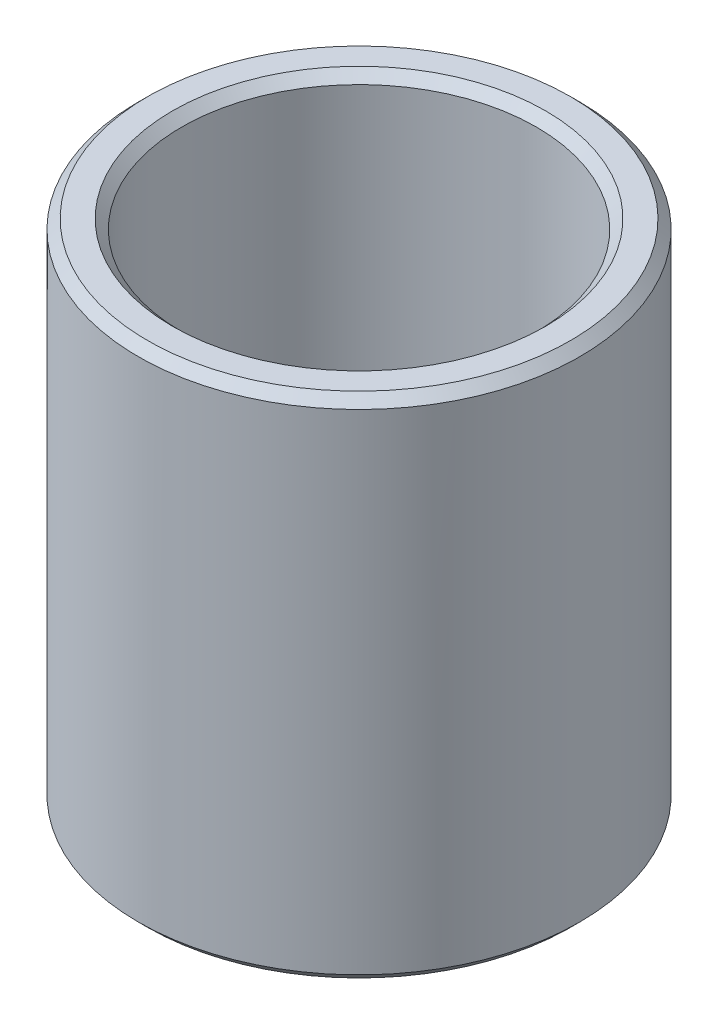
ISO-10303-21;
HEADER;
FILE_DESCRIPTION(('STEP AP214'),'2;1');
FILE_NAME('part.step','',(''),(''),'','','');
FILE_SCHEMA(('AUTOMOTIVE_DESIGN { 1 0 10303 214 1 1 1 1 }'));
ENDSEC;
DATA;
#1=APPLICATION_CONTEXT('core data for automotive mechanical design processes');
#2=APPLICATION_PROTOCOL_DEFINITION('international standard','automotive_design',2000,#1);
#3=PRODUCT_CONTEXT('',#1,'mechanical');
#4=PRODUCT('Part','Part','',(#3));
#5=PRODUCT_RELATED_PRODUCT_CATEGORY('part','',(#4));
#6=PRODUCT_DEFINITION_FORMATION('','',#4);
#7=PRODUCT_DEFINITION_CONTEXT('part definition',#1,'design');
#8=PRODUCT_DEFINITION('design','',#6,#7);
#9=PRODUCT_DEFINITION_SHAPE('','',#8);
#10=(LENGTH_UNIT() NAMED_UNIT(*) SI_UNIT(.MILLI.,.METRE.));
#11=(NAMED_UNIT(*) PLANE_ANGLE_UNIT() SI_UNIT($,.RADIAN.));
#12=(NAMED_UNIT(*) SI_UNIT($,.STERADIAN.) SOLID_ANGLE_UNIT());
#13=UNCERTAINTY_MEASURE_WITH_UNIT(LENGTH_MEASURE(1.E-05),#10,'distance_accuracy_value','');
#14=(GEOMETRIC_REPRESENTATION_CONTEXT(3) GLOBAL_UNCERTAINTY_ASSIGNED_CONTEXT((#13)) GLOBAL_UNIT_ASSIGNED_CONTEXT((#10,
#11,#12)) REPRESENTATION_CONTEXT('',''));
#15=CARTESIAN_POINT('',(0.,0.,0.));
#16=DIRECTION('',(0.,0.,1.));
#17=DIRECTION('',(1.,0.,0.));
#18=AXIS2_PLACEMENT_3D('',#15,#16,#17);
#19=CARTESIAN_POINT('',(0.,74.8433364922086,0.));
#20=DIRECTION('',(0.,-1.,0.));
#21=DIRECTION('',(0.,0.,-1.));
#22=AXIS2_PLACEMENT_3D('',#19,#20,#21);
#23=CYLINDRICAL_SURFACE('',#22,32.5);
#24=CARTESIAN_POINT('',(0.,1.37046416115859,0.));
#25=DIRECTION('',(0.,1.,0.));
#26=DIRECTION('',(0.,0.,1.));
#27=AXIS2_PLACEMENT_3D('',#24,#25,#26);
#28=CIRCLE('',#27,32.5);
#29=CARTESIAN_POINT('',(0.,1.37046416115857,-32.5));
#30=VERTEX_POINT('',#29);
#31=EDGE_CURVE('E10',#30,#30,#28,.T.);
#32=CARTESIAN_POINT('',(0.,73.4728723310501,0.));
#33=DIRECTION('',(0.,1.,0.));
#34=DIRECTION('',(0.,0.,1.));
#35=AXIS2_PLACEMENT_3D('',#32,#33,#34);
#36=CIRCLE('',#35,32.5);
#37=CARTESIAN_POINT('',(0.,73.4728723310501,-32.5));
#38=VERTEX_POINT('',#37);
#39=EDGE_CURVE('E50',#38,#38,#36,.F.);
#40=CARTESIAN_POINT('',(0.,1.37046416115857,-32.5));
#41=CARTESIAN_POINT('',(0.,2.12153091292828,-32.5));
#42=CARTESIAN_POINT('',(0.,2.87259766469798,-32.5));
#43=CARTESIAN_POINT('',(0.,4.37473116823738,-32.5));
#44=CARTESIAN_POINT('',(0.,5.12579792000709,-32.5));
#45=CARTESIAN_POINT('',(0.,6.6279314235465,-32.5));
#46=CARTESIAN_POINT('',(0.,7.3789981753162,-32.5));
#47=CARTESIAN_POINT('',(0.,8.88113167885561,-32.5));
#48=CARTESIAN_POINT('',(0.,9.63219843062531,-32.5));
#49=CARTESIAN_POINT('',(0.,11.1343319341647,-32.5));
#50=CARTESIAN_POINT('',(0.,11.8853986859344,-32.5));
#51=CARTESIAN_POINT('',(0.,13.3875321894738,-32.5));
#52=CARTESIAN_POINT('',(0.,14.1385989412435,-32.5));
#53=CARTESIAN_POINT('',(0.,15.6407324447829,-32.5));
#54=CARTESIAN_POINT('',(0.,16.3917991965526,-32.5));
#55=CARTESIAN_POINT('',(0.,17.893932700092,-32.5));
#56=CARTESIAN_POINT('',(0.,18.6449994518617,-32.5));
#57=CARTESIAN_POINT('',(0.,20.1471329554012,-32.5));
#58=CARTESIAN_POINT('',(0.,20.8981997071709,-32.5));
#59=CARTESIAN_POINT('',(0.,22.4003332107103,-32.5));
#60=CARTESIAN_POINT('',(0.,23.15139996248,-32.5));
#61=CARTESIAN_POINT('',(0.,24.6535334660194,-32.5));
#62=CARTESIAN_POINT('',(0.,25.4046002177891,-32.5));
#63=CARTESIAN_POINT('',(0.,26.9067337213285,-32.5));
#64=CARTESIAN_POINT('',(0.,27.6578004730982,-32.5));
#65=CARTESIAN_POINT('',(0.,29.1599339766376,-32.5));
#66=CARTESIAN_POINT('',(0.,29.9110007284073,-32.5));
#67=CARTESIAN_POINT('',(0.,31.4131342319467,-32.5));
#68=CARTESIAN_POINT('',(0.,32.1642009837164,-32.5));
#69=CARTESIAN_POINT('',(0.,33.6663344872558,-32.5));
#70=CARTESIAN_POINT('',(0.,34.4174012390255,-32.5));
#71=CARTESIAN_POINT('',(0.,35.9195347425649,-32.5));
#72=CARTESIAN_POINT('',(0.,36.6706014943346,-32.5));
#73=CARTESIAN_POINT('',(0.,38.172734997874,-32.5));
#74=CARTESIAN_POINT('',(0.,38.9238017496437,-32.5));
#75=CARTESIAN_POINT('',(0.,40.4259352531831,-32.5));
#76=CARTESIAN_POINT('',(0.,41.1770020049528,-32.5));
#77=CARTESIAN_POINT('',(0.,42.6791355084923,-32.5));
#78=CARTESIAN_POINT('',(0.,43.4302022602619,-32.5));
#79=CARTESIAN_POINT('',(0.,44.9323357638014,-32.5));
#80=CARTESIAN_POINT('',(0.,45.6834025155711,-32.5));
#81=CARTESIAN_POINT('',(0.,47.1855360191105,-32.5));
#82=CARTESIAN_POINT('',(0.,47.9366027708802,-32.5));
#83=CARTESIAN_POINT('',(0.,49.4387362744196,-32.5));
#84=CARTESIAN_POINT('',(0.,50.1898030261893,-32.5));
#85=CARTESIAN_POINT('',(0.,51.6919365297287,-32.5));
#86=CARTESIAN_POINT('',(0.,52.4430032814984,-32.5));
#87=CARTESIAN_POINT('',(0.,53.9451367850378,-32.5));
#88=CARTESIAN_POINT('',(0.,54.6962035368075,-32.5));
#89=CARTESIAN_POINT('',(0.,56.1983370403469,-32.5));
#90=CARTESIAN_POINT('',(0.,56.9494037921166,-32.5));
#91=CARTESIAN_POINT('',(0.,58.451537295656,-32.5));
#92=CARTESIAN_POINT('',(0.,59.2026040474257,-32.5));
#93=CARTESIAN_POINT('',(0.,60.7047375509651,-32.5));
#94=CARTESIAN_POINT('',(0.,61.4558043027348,-32.5));
#95=CARTESIAN_POINT('',(0.,62.9579378062742,-32.5));
#96=CARTESIAN_POINT('',(0.,63.7090045580439,-32.5));
#97=CARTESIAN_POINT('',(0.,65.2111380615833,-32.5));
#98=CARTESIAN_POINT('',(0.,65.962204813353,-32.5));
#99=CARTESIAN_POINT('',(0.,67.4643383168924,-32.5));
#100=CARTESIAN_POINT('',(0.,68.2154050686622,-32.5));
#101=CARTESIAN_POINT('',(0.,69.7175385722016,-32.5));
#102=CARTESIAN_POINT('',(0.,70.4686053239713,-32.5));
#103=CARTESIAN_POINT('',(0.,71.9707388275107,-32.5));
#104=CARTESIAN_POINT('',(0.,72.7218055792804,-32.5));
#105=CARTESIAN_POINT('',(0.,73.4728723310501,-32.5));
#106=B_SPLINE_CURVE_WITH_KNOTS('',3,(#40,#41,#42,#43,#44,#45,#46,#47,#48,#49,#50,#51,#52,#53,
#54,#55,#56,#57,#58,#59,#60,#61,#62,#63,#64,#65,#66,#67,#68,#69,#70,#71,#72,#73,#74,#75,#76,#77,
#78,#79,#80,#81,#82,#83,#84,#85,#86,#87,#88,#89,#90,#91,#92,#93,#94,#95,#96,#97,#98,#99,#100,
#101,#102,#103,#104,#105),.UNSPECIFIED.,.F.,.F.,(4,2,2,2,2,2,2,2,2,2,2,2,2,2,2,2,2,2,2,2,2,2,2,
2,2,2,2,2,2,2,2,2,4),(0.,2.2532002553091,4.50640051061822,6.75960076592733,9.01280102123644,
11.2660012765455,13.5192015318547,15.7724017871638,18.0256020424729,20.278802297782,
22.5320025530911,24.7852028084002,27.0384030637093,29.2916033190184,31.5448035743275,
33.7980038296366,36.0512040849457,38.3044043402549,40.557604595564,42.8108048508731,
45.0640051061822,47.3172053614913,49.5704056168004,51.8236058721095,54.0768061274186,
56.3300063827277,58.5832066380368,60.8364068933459,63.0896071486551,65.3428074039642,
67.5960076592733,69.8492079145824,72.1024081698915),.UNSPECIFIED.);
#107=EDGE_CURVE('BSEAM39',#30,#38,#106,.T.);
#108=ORIENTED_EDGE('',*,*,#31,.T.);
#109=ORIENTED_EDGE('',*,*,#39,.T.);
#110=ORIENTED_EDGE('',*,*,#107,.T.);
#111=ORIENTED_EDGE('',*,*,#107,.F.);
#112=EDGE_LOOP('',(#108,#110,#109,#111));
#113=FACE_BOUND('',#112,.T.);
#114=ADVANCED_FACE('F39',(#113),#23,.T.);
#115=CARTESIAN_POINT('',(0.,74.8433364922086,0.));
#116=DIRECTION('',(0.,1.,0.));
#117=DIRECTION('',(0.,0.,1.));
#118=AXIS2_PLACEMENT_3D('',#115,#116,#117);
#119=PLANE('',#118);
#120=CARTESIAN_POINT('',(0.,74.8433364922086,0.));
#121=DIRECTION('',(0.,1.,0.));
#122=DIRECTION('',(0.,0.,1.));
#123=AXIS2_PLACEMENT_3D('',#120,#121,#122);
#124=CIRCLE('',#123,27.4808190527714);
#125=CARTESIAN_POINT('',(0.,74.8433364922086,27.4808190527714));
#126=VERTEX_POINT('',#125);
#127=EDGE_CURVE('E58',#126,#126,#124,.F.);
#128=ORIENTED_EDGE('',*,*,#127,.T.);
#129=EDGE_LOOP('',(#128));
#130=FACE_BOUND('',#129,.T.);
#131=CARTESIAN_POINT('',(0.,74.8433364922086,0.));
#132=DIRECTION('',(0.,1.,0.));
#133=DIRECTION('',(0.,0.,1.));
#134=AXIS2_PLACEMENT_3D('',#131,#132,#133);
#135=CIRCLE('',#134,31.1295358388415);
#136=CARTESIAN_POINT('',(0.,74.8433364922086,-31.1295358388415));
#137=VERTEX_POINT('',#136);
#138=EDGE_CURVE('E61',#137,#137,#135,.T.);
#139=ORIENTED_EDGE('',*,*,#138,.T.);
#140=EDGE_LOOP('',(#139));
#141=FACE_BOUND('',#140,.T.);
#142=ADVANCED_FACE('F88',(#130,#141),#119,.T.);
#143=CARTESIAN_POINT('',(0.,0.,0.));
#144=DIRECTION('',(0.,1.,0.));
#145=DIRECTION('',(0.,0.,1.));
#146=AXIS2_PLACEMENT_3D('',#143,#144,#145);
#147=PLANE('',#146);
#148=CARTESIAN_POINT('',(0.,0.,0.));
#149=DIRECTION('',(0.,1.,0.));
#150=DIRECTION('',(0.,0.,1.));
#151=AXIS2_PLACEMENT_3D('',#148,#149,#150);
#152=CIRCLE('',#151,27.4808190527714);
#153=CARTESIAN_POINT('',(0.,0.,-27.4808190527714));
#154=VERTEX_POINT('',#153);
#155=EDGE_CURVE('E51',#154,#154,#152,.T.);
#156=ORIENTED_EDGE('',*,*,#155,.T.);
#157=EDGE_LOOP('',(#156));
#158=FACE_BOUND('',#157,.T.);
#159=CARTESIAN_POINT('',(0.,0.,0.));
#160=DIRECTION('',(0.,1.,0.));
#161=DIRECTION('',(0.,0.,1.));
#162=AXIS2_PLACEMENT_3D('',#159,#160,#161);
#163=CIRCLE('',#162,31.1295358388414);
#164=CARTESIAN_POINT('',(0.,0.,31.1295358388414));
#165=VERTEX_POINT('',#164);
#166=EDGE_CURVE('E54',#165,#165,#163,.F.);
#167=ORIENTED_EDGE('',*,*,#166,.T.);
#168=EDGE_LOOP('',(#167));
#169=FACE_BOUND('',#168,.T.);
#170=ADVANCED_FACE('F83',(#158,#169),#147,.F.);
#171=CARTESIAN_POINT('',(0.,74.8433364922086,0.));
#172=DIRECTION('',(0.,-1.,0.));
#173=DIRECTION('',(0.,0.,-1.));
#174=AXIS2_PLACEMENT_3D('',#171,#172,#173);
#175=CYLINDRICAL_SURFACE('',#174,26.1103548916129);
#176=CARTESIAN_POINT('',(0.,73.47287233105,0.));
#177=DIRECTION('',(0.,1.,0.));
#178=DIRECTION('',(0.,0.,1.));
#179=AXIS2_PLACEMENT_3D('',#176,#177,#178);
#180=CIRCLE('',#179,26.1103548916129);
#181=CARTESIAN_POINT('',(0.,73.47287233105,-26.1103548916129));
#182=VERTEX_POINT('',#181);
#183=EDGE_CURVE('E67',#182,#182,#180,.T.);
#184=CARTESIAN_POINT('',(0.,1.37046416115857,0.));
#185=DIRECTION('',(0.,1.,0.));
#186=DIRECTION('',(0.,0.,1.));
#187=AXIS2_PLACEMENT_3D('',#184,#185,#186);
#188=CIRCLE('',#187,26.1103548916129);
#189=CARTESIAN_POINT('',(0.,1.37046416115857,-26.1103548916129));
#190=VERTEX_POINT('',#189);
#191=EDGE_CURVE('E69',#190,#190,#188,.F.);
#192=CARTESIAN_POINT('',(0.,73.47287233105,-26.1103548916129));
#193=CARTESIAN_POINT('',(0.,72.7218055792803,-26.1103548916129));
#194=CARTESIAN_POINT('',(0.,71.9707388275106,-26.1103548916129));
#195=CARTESIAN_POINT('',(0.,70.4686053239712,-26.1103548916129));
#196=CARTESIAN_POINT('',(0.,69.7175385722015,-26.1103548916129));
#197=CARTESIAN_POINT('',(0.,68.2154050686621,-26.1103548916129));
#198=CARTESIAN_POINT('',(0.,67.4643383168924,-26.1103548916129));
#199=CARTESIAN_POINT('',(0.,65.962204813353,-26.1103548916129));
#200=CARTESIAN_POINT('',(0.,65.2111380615833,-26.1103548916129));
#201=CARTESIAN_POINT('',(0.,63.7090045580439,-26.1103548916129));
#202=CARTESIAN_POINT('',(0.,62.9579378062742,-26.1103548916129));
#203=CARTESIAN_POINT('',(0.,61.4558043027348,-26.1103548916129));
#204=CARTESIAN_POINT('',(0.,60.7047375509651,-26.1103548916129));
#205=CARTESIAN_POINT('',(0.,59.2026040474257,-26.1103548916129));
#206=CARTESIAN_POINT('',(0.,58.451537295656,-26.1103548916129));
#207=CARTESIAN_POINT('',(0.,56.9494037921166,-26.1103548916129));
#208=CARTESIAN_POINT('',(0.,56.1983370403469,-26.1103548916129));
#209=CARTESIAN_POINT('',(0.,54.6962035368075,-26.1103548916129));
#210=CARTESIAN_POINT('',(0.,53.9451367850378,-26.1103548916129));
#211=CARTESIAN_POINT('',(0.,52.4430032814984,-26.1103548916129));
#212=CARTESIAN_POINT('',(0.,51.6919365297287,-26.1103548916129));
#213=CARTESIAN_POINT('',(0.,50.1898030261893,-26.1103548916129));
#214=CARTESIAN_POINT('',(0.,49.4387362744195,-26.1103548916129));
#215=CARTESIAN_POINT('',(0.,47.9366027708801,-26.1103548916129));
#216=CARTESIAN_POINT('',(0.,47.1855360191104,-26.1103548916129));
#217=CARTESIAN_POINT('',(0.,45.683402515571,-26.1103548916129));
#218=CARTESIAN_POINT('',(0.,44.9323357638013,-26.1103548916129));
#219=CARTESIAN_POINT('',(0.,43.4302022602619,-26.1103548916129));
#220=CARTESIAN_POINT('',(0.,42.6791355084922,-26.1103548916129));
#221=CARTESIAN_POINT('',(0.,41.1770020049528,-26.1103548916129));
#222=CARTESIAN_POINT('',(0.,40.4259352531831,-26.1103548916129));
#223=CARTESIAN_POINT('',(0.,38.9238017496437,-26.1103548916129));
#224=CARTESIAN_POINT('',(0.,38.172734997874,-26.1103548916129));
#225=CARTESIAN_POINT('',(0.,36.6706014943346,-26.1103548916129));
#226=CARTESIAN_POINT('',(0.,35.9195347425649,-26.1103548916129));
#227=CARTESIAN_POINT('',(0.,34.4174012390255,-26.1103548916129));
#228=CARTESIAN_POINT('',(0.,33.6663344872558,-26.1103548916129));
#229=CARTESIAN_POINT('',(0.,32.1642009837164,-26.1103548916129));
#230=CARTESIAN_POINT('',(0.,31.4131342319467,-26.1103548916129));
#231=CARTESIAN_POINT('',(0.,29.9110007284073,-26.1103548916129));
#232=CARTESIAN_POINT('',(0.,29.1599339766376,-26.1103548916129));
#233=CARTESIAN_POINT('',(0.,27.6578004730982,-26.1103548916129));
#234=CARTESIAN_POINT('',(0.,26.9067337213285,-26.1103548916129));
#235=CARTESIAN_POINT('',(0.,25.4046002177891,-26.1103548916129));
#236=CARTESIAN_POINT('',(0.,24.6535334660194,-26.1103548916129));
#237=CARTESIAN_POINT('',(0.,23.1513999624799,-26.1103548916129));
#238=CARTESIAN_POINT('',(0.,22.4003332107102,-26.1103548916129));
#239=CARTESIAN_POINT('',(0.,20.8981997071708,-26.1103548916129));
#240=CARTESIAN_POINT('',(0.,20.1471329554011,-26.1103548916129));
#241=CARTESIAN_POINT('',(0.,18.6449994518617,-26.1103548916129));
#242=CARTESIAN_POINT('',(0.,17.893932700092,-26.1103548916129));
#243=CARTESIAN_POINT('',(0.,16.3917991965526,-26.1103548916129));
#244=CARTESIAN_POINT('',(0.,15.6407324447829,-26.1103548916129));
#245=CARTESIAN_POINT('',(0.,14.1385989412435,-26.1103548916129));
#246=CARTESIAN_POINT('',(0.,13.3875321894738,-26.1103548916129));
#247=CARTESIAN_POINT('',(0.,11.8853986859344,-26.1103548916129));
#248=CARTESIAN_POINT('',(0.,11.1343319341647,-26.1103548916129));
#249=CARTESIAN_POINT('',(0.,9.63219843062529,-26.1103548916129));
#250=CARTESIAN_POINT('',(0.,8.8811316788556,-26.1103548916129));
#251=CARTESIAN_POINT('',(0.,7.37899817531619,-26.1103548916129));
#252=CARTESIAN_POINT('',(0.,6.62793142354649,-26.1103548916129));
#253=CARTESIAN_POINT('',(0.,5.12579792000708,-26.1103548916129));
#254=CARTESIAN_POINT('',(0.,4.37473116823737,-26.1103548916129));
#255=CARTESIAN_POINT('',(0.,2.87259766469797,-26.1103548916129));
#256=CARTESIAN_POINT('',(0.,2.12153091292827,-26.1103548916129));
#257=CARTESIAN_POINT('',(0.,1.37046416115857,-26.1103548916129));
#258=B_SPLINE_CURVE_WITH_KNOTS('',3,(#192,#193,#194,#195,#196,#197,#198,#199,#200,#201,#202,
#203,#204,#205,#206,#207,#208,#209,#210,#211,#212,#213,#214,#215,#216,#217,#218,#219,#220,#221,
#222,#223,#224,#225,#226,#227,#228,#229,#230,#231,#232,#233,#234,#235,#236,#237,#238,#239,#240,
#241,#242,#243,#244,#245,#246,#247,#248,#249,#250,#251,#252,#253,#254,#255,#256,#257),
.UNSPECIFIED.,.F.,.F.,(4,2,2,2,2,2,2,2,2,2,2,2,2,2,2,2,2,2,2,2,2,2,2,2,2,2,2,2,2,2,2,2,4),(0.,
2.25320025530912,4.50640051061822,6.75960076592733,9.01280102123644,11.2660012765455,
13.5192015318547,15.7724017871638,18.0256020424729,20.278802297782,22.5320025530911,
24.7852028084002,27.0384030637093,29.2916033190184,31.5448035743275,33.7980038296366,
36.0512040849457,38.3044043402549,40.557604595564,42.8108048508731,45.0640051061822,
47.3172053614913,49.5704056168004,51.8236058721095,54.0768061274186,56.3300063827277,
58.5832066380368,60.8364068933459,63.0896071486551,65.3428074039641,67.5960076592733,
69.8492079145824,72.1024081698915),.UNSPECIFIED.);
#259=EDGE_CURVE('BSEAM71',#182,#190,#258,.T.);
#260=ORIENTED_EDGE('',*,*,#183,.T.);
#261=ORIENTED_EDGE('',*,*,#191,.T.);
#262=ORIENTED_EDGE('',*,*,#259,.T.);
#263=ORIENTED_EDGE('',*,*,#259,.F.);
#264=EDGE_LOOP('',(#260,#262,#261,#263));
#265=FACE_BOUND('',#264,.T.);
#266=ADVANCED_FACE('F71',(#265),#175,.F.);
#267=CARTESIAN_POINT('',(0.,73.47287233105,0.));
#268=DIRECTION('',(0.,1.,0.));
#269=DIRECTION('',(0.,0.,1.));
#270=AXIS2_PLACEMENT_3D('',#267,#268,#269);
#271=CONICAL_SURFACE('',#270,26.1103548916129,0.785398163397447);
#272=ORIENTED_EDGE('',*,*,#127,.F.);
#273=EDGE_LOOP('',(#272));
#274=FACE_BOUND('',#273,.T.);
#275=ORIENTED_EDGE('',*,*,#183,.F.);
#276=EDGE_LOOP('',(#275));
#277=FACE_BOUND('',#276,.T.);
#278=ADVANCED_FACE('F77',(#274,#277),#271,.F.);
#279=CARTESIAN_POINT('',(0.,0.,0.));
#280=DIRECTION('',(0.,-1.,0.));
#281=DIRECTION('',(0.,0.,-1.));
#282=AXIS2_PLACEMENT_3D('',#279,#280,#281);
#283=CONICAL_SURFACE('',#282,27.4808190527714,0.785398163397446);
#284=CARTESIAN_POINT('',(0.,1.37046416115857,-26.1103548916129));
#285=CARTESIAN_POINT('',(0.,1.35618849281317,-26.1246305599583));
#286=CARTESIAN_POINT('',(0.,1.34191282446777,-26.1389062283037));
#287=CARTESIAN_POINT('',(0.,1.31336148777697,-26.1674575649945));
#288=CARTESIAN_POINT('',(0.,1.29908581943156,-26.1817332333399));
#289=CARTESIAN_POINT('',(0.,1.27053448274076,-26.2102845700307));
#290=CARTESIAN_POINT('',(0.,1.25625881439536,-26.2245602383761));
#291=CARTESIAN_POINT('',(0.,1.22770747770456,-26.2531115750669));
#292=CARTESIAN_POINT('',(0.,1.21343180935915,-26.2673872434123));
#293=CARTESIAN_POINT('',(0.,1.18488047266835,-26.2959385801031));
#294=CARTESIAN_POINT('',(0.,1.17060480432295,-26.3102142484485));
#295=CARTESIAN_POINT('',(0.,1.14205346763215,-26.3387655851393));
#296=CARTESIAN_POINT('',(0.,1.12777779928674,-26.3530412534847));
#297=CARTESIAN_POINT('',(0.,1.09922646259594,-26.3815925901755));
#298=CARTESIAN_POINT('',(0.,1.08495079425054,-26.3958682585209));
#299=CARTESIAN_POINT('',(0.,1.05639945755973,-26.4244195952117));
#300=CARTESIAN_POINT('',(0.,1.04212378921433,-26.4386952635571));
#301=CARTESIAN_POINT('',(0.,1.01357245252353,-26.4672466002479));
#302=CARTESIAN_POINT('',(0.,0.999296784178127,-26.4815222685933));
#303=CARTESIAN_POINT('',(0.,0.970745447487323,-26.5100736052841));
#304=CARTESIAN_POINT('',(0.,0.956469779141921,-26.5243492736295));
#305=CARTESIAN_POINT('',(0.,0.927918442451118,-26.5529006103203));
#306=CARTESIAN_POINT('',(0.,0.913642774105717,-26.5671762786657));
#307=CARTESIAN_POINT('',(0.,0.885091437414913,-26.5957276153565));
#308=CARTESIAN_POINT('',(0.,0.870815769069511,-26.6100032837019));
#309=CARTESIAN_POINT('',(0.,0.842264432378707,-26.6385546203927));
#310=CARTESIAN_POINT('',(0.,0.827988764033305,-26.6528302887381));
#311=CARTESIAN_POINT('',(0.,0.799437427342502,-26.6813816254289));
#312=CARTESIAN_POINT('',(0.,0.7851617589971,-26.6956572937743));
#313=CARTESIAN_POINT('',(0.,0.756610422306296,-26.7242086304651));
#314=CARTESIAN_POINT('',(0.,0.742334753960894,-26.7384842988105));
#315=CARTESIAN_POINT('',(0.,0.71378341727009,-26.7670356355013));
#316=CARTESIAN_POINT('',(0.,0.699507748924689,-26.7813113038467));
#317=CARTESIAN_POINT('',(0.,0.670956412233885,-26.8098626405375));
#318=CARTESIAN_POINT('',(0.,0.656680743888484,-26.8241383088829));
#319=CARTESIAN_POINT('',(0.,0.62812940719768,-26.8526896455737));
#320=CARTESIAN_POINT('',(0.,0.613853738852278,-26.8669653139191));
#321=CARTESIAN_POINT('',(0.,0.585302402161474,-26.8955166506099));
#322=CARTESIAN_POINT('',(0.,0.571026733816072,-26.9097923189554));
#323=CARTESIAN_POINT('',(0.,0.542475397125269,-26.9383436556462));
#324=CARTESIAN_POINT('',(0.,0.528199728779868,-26.9526193239916));
#325=CARTESIAN_POINT('',(0.,0.499648392089064,-26.9811706606824));
#326=CARTESIAN_POINT('',(0.,0.485372723743661,-26.9954463290278));
#327=CARTESIAN_POINT('',(0.,0.456821387052858,-27.0239976657186));
#328=CARTESIAN_POINT('',(0.,0.442545718707456,-27.038273334064));
#329=CARTESIAN_POINT('',(0.,0.413994382016653,-27.0668246707548));
#330=CARTESIAN_POINT('',(0.,0.399718713671251,-27.0811003391002));
#331=CARTESIAN_POINT('',(0.,0.371167376980447,-27.109651675791));
#332=CARTESIAN_POINT('',(0.,0.356891708635046,-27.1239273441364));
#333=CARTESIAN_POINT('',(0.,0.328340371944242,-27.1524786808272));
#334=CARTESIAN_POINT('',(0.,0.31406470359884,-27.1667543491726));
#335=CARTESIAN_POINT('',(0.,0.285513366908036,-27.1953056858634));
#336=CARTESIAN_POINT('',(0.,0.271237698562634,-27.2095813542088));
#337=CARTESIAN_POINT('',(0.,0.242686361871831,-27.2381326908996));
#338=CARTESIAN_POINT('',(0.,0.228410693526429,-27.252408359245));
#339=CARTESIAN_POINT('',(0.,0.199859356835626,-27.2809596959358));
#340=CARTESIAN_POINT('',(0.,0.185583688490223,-27.2952353642812));
#341=CARTESIAN_POINT('',(0.,0.15703235179942,-27.323786700972));
#342=CARTESIAN_POINT('',(0.,0.142756683454018,-27.3380623693174));
#343=CARTESIAN_POINT('',(0.,0.114205346763215,-27.3666137060082));
#344=CARTESIAN_POINT('',(0.,0.099929678417813,-27.3808893743536));
#345=CARTESIAN_POINT('',(0.,0.0713783417270093,-27.4094407110444));
#346=CARTESIAN_POINT('',(0.,0.0571026733816072,-27.4237163793898));
#347=CARTESIAN_POINT('',(0.,0.0285513366908031,-27.4522677160806));
#348=CARTESIAN_POINT('',(0.,0.014275668345401,-27.466543384426));
#349=CARTESIAN_POINT('',(0.,0.,-27.4808190527714));
#350=B_SPLINE_CURVE_WITH_KNOTS('',3,(#284,#285,#286,#287,#288,#289,#290,#291,#292,#293,#294,
#295,#296,#297,#298,#299,#300,#301,#302,#303,#304,#305,#306,#307,#308,#309,#310,#311,#312,#313,
#314,#315,#316,#317,#318,#319,#320,#321,#322,#323,#324,#325,#326,#327,#328,#329,#330,#331,#332,
#333,#334,#335,#336,#337,#338,#339,#340,#341,#342,#343,#344,#345,#346,#347,#348,#349),
.UNSPECIFIED.,.F.,.F.,(4,2,2,2,2,2,2,2,2,2,2,2,2,2,2,2,2,2,2,2,2,2,2,2,2,2,2,2,2,2,2,2,4),(0.,
0.0605665313580232,0.121133062716044,0.181699594074067,0.24226612543209,0.302832656790114,
0.363399188148134,0.423965719506158,0.484532250864181,0.545098782222201,0.605665313580225,
0.666231844938248,0.726798376296269,0.787364907654292,0.847931439012315,0.908497970370336,
0.969064501728359,1.02963103308638,1.0901975644444,1.15076409580243,1.21133062716045,
1.27189715851847,1.33246368987649,1.39303022123452,1.45359675259254,1.51416328395056,
1.57472981530858,1.63529634666661,1.69586287802463,1.75642940938265,1.81699594074067,
1.87756247209869,1.93812900345672),.UNSPECIFIED.);
#351=EDGE_CURVE('BSEAM73',#190,#154,#350,.T.);
#352=ORIENTED_EDGE('',*,*,#191,.F.);
#353=ORIENTED_EDGE('',*,*,#155,.F.);
#354=ORIENTED_EDGE('',*,*,#351,.T.);
#355=ORIENTED_EDGE('',*,*,#351,.F.);
#356=EDGE_LOOP('',(#352,#354,#353,#355));
#357=FACE_BOUND('',#356,.T.);
#358=ADVANCED_FACE('F73',(#357),#283,.F.);
#359=CARTESIAN_POINT('',(0.,1.37046416115859,0.));
#360=DIRECTION('',(0.,1.,0.));
#361=DIRECTION('',(0.,0.,1.));
#362=AXIS2_PLACEMENT_3D('',#359,#360,#361);
#363=CONICAL_SURFACE('',#362,32.5,0.785398163397453);
#364=ORIENTED_EDGE('',*,*,#166,.F.);
#365=EDGE_LOOP('',(#364));
#366=FACE_BOUND('',#365,.T.);
#367=ORIENTED_EDGE('',*,*,#31,.F.);
#368=EDGE_LOOP('',(#367));
#369=FACE_BOUND('',#368,.T.);
#370=ADVANCED_FACE('F76',(#366,#369),#363,.T.);
#371=CARTESIAN_POINT('',(0.,74.8433364922086,0.));
#372=DIRECTION('',(0.,-1.,0.));
#373=DIRECTION('',(0.,0.,-1.));
#374=AXIS2_PLACEMENT_3D('',#371,#372,#373);
#375=CONICAL_SURFACE('',#374,31.1295358388415,0.785398163397448);
#376=CARTESIAN_POINT('',(0.,73.4728723310501,-32.5));
#377=CARTESIAN_POINT('',(0.,73.4871479993955,-32.4857243316546));
#378=CARTESIAN_POINT('',(0.,73.5014236677409,-32.4714486633092));
#379=CARTESIAN_POINT('',(0.,73.5299750044317,-32.4428973266184));
#380=CARTESIAN_POINT('',(0.,73.5442506727771,-32.428621658273));
#381=CARTESIAN_POINT('',(0.,73.5728020094679,-32.4000703215822));
#382=CARTESIAN_POINT('',(0.,73.5870776778133,-32.3857946532368));
#383=CARTESIAN_POINT('',(0.,73.6156290145041,-32.357243316546));
#384=CARTESIAN_POINT('',(0.,73.6299046828495,-32.3429676482006));
#385=CARTESIAN_POINT('',(0.,73.6584560195403,-32.3144163115098));
#386=CARTESIAN_POINT('',(0.,73.6727316878857,-32.3001406431644));
#387=CARTESIAN_POINT('',(0.,73.7012830245765,-32.2715893064736));
#388=CARTESIAN_POINT('',(0.,73.7155586929219,-32.2573136381282));
#389=CARTESIAN_POINT('',(0.,73.7441100296127,-32.2287623014374));
#390=CARTESIAN_POINT('',(0.,73.7583856979581,-32.214486633092));
#391=CARTESIAN_POINT('',(0.,73.7869370346489,-32.1859352964012));
#392=CARTESIAN_POINT('',(0.,73.8012127029943,-32.1716596280558));
#393=CARTESIAN_POINT('',(0.,73.8297640396851,-32.143108291365));
#394=CARTESIAN_POINT('',(0.,73.8440397080305,-32.1288326230196));
#395=CARTESIAN_POINT('',(0.,73.8725910447213,-32.1002812863288));
#396=CARTESIAN_POINT('',(0.,73.8868667130667,-32.0860056179834));
#397=CARTESIAN_POINT('',(0.,73.9154180497575,-32.0574542812926));
#398=CARTESIAN_POINT('',(0.,73.9296937181029,-32.0431786129472));
#399=CARTESIAN_POINT('',(0.,73.9582450547937,-32.0146272762564));
#400=CARTESIAN_POINT('',(0.,73.9725207231391,-32.000351607911));
#401=CARTESIAN_POINT('',(0.,74.0010720598299,-31.9718002712202));
#402=CARTESIAN_POINT('',(0.,74.0153477281753,-31.9575246028748));
#403=CARTESIAN_POINT('',(0.,74.0438990648661,-31.9289732661839));
#404=CARTESIAN_POINT('',(0.,74.0581747332115,-31.9146975978385));
#405=CARTESIAN_POINT('',(0.,74.0867260699023,-31.8861462611477));
#406=CARTESIAN_POINT('',(0.,74.1010017382477,-31.8718705928023));
#407=CARTESIAN_POINT('',(0.,74.1295530749385,-31.8433192561115));
#408=CARTESIAN_POINT('',(0.,74.1438287432839,-31.8290435877661));
#409=CARTESIAN_POINT('',(0.,74.1723800799747,-31.8004922510753));
#410=CARTESIAN_POINT('',(0.,74.1866557483201,-31.7862165827299));
#411=CARTESIAN_POINT('',(0.,74.2152070850109,-31.7576652460391));
#412=CARTESIAN_POINT('',(0.,74.2294827533564,-31.7433895776937));
#413=CARTESIAN_POINT('',(0.,74.2580340900471,-31.7148382410029));
#414=CARTESIAN_POINT('',(0.,74.2723097583926,-31.7005625726575));
#415=CARTESIAN_POINT('',(0.,74.3008610950833,-31.6720112359667));
#416=CARTESIAN_POINT('',(0.,74.3151367634288,-31.6577355676213));
#417=CARTESIAN_POINT('',(0.,74.3436881001196,-31.6291842309305));
#418=CARTESIAN_POINT('',(0.,74.357963768465,-31.6149085625851));
#419=CARTESIAN_POINT('',(0.,74.3865151051558,-31.5863572258943));
#420=CARTESIAN_POINT('',(0.,74.4007907735012,-31.5720815575489));
#421=CARTESIAN_POINT('',(0.,74.429342110192,-31.5435302208581));
#422=CARTESIAN_POINT('',(0.,74.4436177785374,-31.5292545525127));
#423=CARTESIAN_POINT('',(0.,74.4721691152282,-31.5007032158219));
#424=CARTESIAN_POINT('',(0.,74.4864447835736,-31.4864275474765));
#425=CARTESIAN_POINT('',(0.,74.5149961202644,-31.4578762107857));
#426=CARTESIAN_POINT('',(0.,74.5292717886098,-31.4436005424403));
#427=CARTESIAN_POINT('',(0.,74.5578231253006,-31.4150492057495));
#428=CARTESIAN_POINT('',(0.,74.572098793646,-31.4007735374041));
#429=CARTESIAN_POINT('',(0.,74.6006501303368,-31.3722222007133));
#430=CARTESIAN_POINT('',(0.,74.6149257986822,-31.3579465323679));
#431=CARTESIAN_POINT('',(0.,74.643477135373,-31.3293951956771));
#432=CARTESIAN_POINT('',(0.,74.6577528037184,-31.3151195273317));
#433=CARTESIAN_POINT('',(0.,74.6863041404092,-31.2865681906409));
#434=CARTESIAN_POINT('',(0.,74.7005798087546,-31.2722925222955));
#435=CARTESIAN_POINT('',(0.,74.7291311454454,-31.2437411856047));
#436=CARTESIAN_POINT('',(0.,74.7434068137908,-31.2294655172593));
#437=CARTESIAN_POINT('',(0.,74.7719581504816,-31.2009141805685));
#438=CARTESIAN_POINT('',(0.,74.786233818827,-31.1866385122231));
#439=CARTESIAN_POINT('',(0.,74.8147851555178,-31.1580871755323));
#440=CARTESIAN_POINT('',(0.,74.8290608238632,-31.1438115071869));
#441=CARTESIAN_POINT('',(0.,74.8433364922086,-31.1295358388415));
#442=B_SPLINE_CURVE_WITH_KNOTS('',3,(#376,#377,#378,#379,#380,#381,#382,#383,#384,#385,#386,
#387,#388,#389,#390,#391,#392,#393,#394,#395,#396,#397,#398,#399,#400,#401,#402,#403,#404,#405,
#406,#407,#408,#409,#410,#411,#412,#413,#414,#415,#416,#417,#418,#419,#420,#421,#422,#423,#424,
#425,#426,#427,#428,#429,#430,#431,#432,#433,#434,#435,#436,#437,#438,#439,#440,#441),
.UNSPECIFIED.,.F.,.F.,(4,2,2,2,2,2,2,2,2,2,2,2,2,2,2,2,2,2,2,2,2,2,2,2,2,2,2,2,2,2,2,2,4),(0.,
0.0605665313580287,0.121133062716048,0.181699594074071,0.24226612543209,0.302832656790109,
0.363399188148128,0.423965719506152,0.484532250864171,0.5450987822222,0.605665313580219,
0.666231844938243,0.726798376296261,0.78736490765428,0.847931439012299,0.908497970370323,
0.969064501728342,1.02963103308637,1.09019756444439,1.15076409580241,1.21133062716043,
1.27189715851845,1.33246368987647,1.39303022123449,1.45359675259252,1.51416328395054,
1.57472981530857,1.63529634666658,1.6958628780246,1.75642940938262,1.81699594074064,
1.87756247209867,1.93812900345669),.UNSPECIFIED.);
#443=EDGE_CURVE('BSEAM45',#38,#137,#442,.T.);
#444=ORIENTED_EDGE('',*,*,#39,.F.);
#445=ORIENTED_EDGE('',*,*,#138,.F.);
#446=ORIENTED_EDGE('',*,*,#443,.T.);
#447=ORIENTED_EDGE('',*,*,#443,.F.);
#448=EDGE_LOOP('',(#444,#446,#445,#447));
#449=FACE_BOUND('',#448,.T.);
#450=ADVANCED_FACE('F45',(#449),#375,.T.);
#451=CLOSED_SHELL('',(#114,#142,#170,#266,#278,#358,#370,#450));
#452=MANIFOLD_SOLID_BREP('B2',#451);
#453=ADVANCED_BREP_SHAPE_REPRESENTATION('',(#18,#452),#14);
#454=SHAPE_DEFINITION_REPRESENTATION(#9,#453);
ENDSEC;
END-ISO-10303-21;
